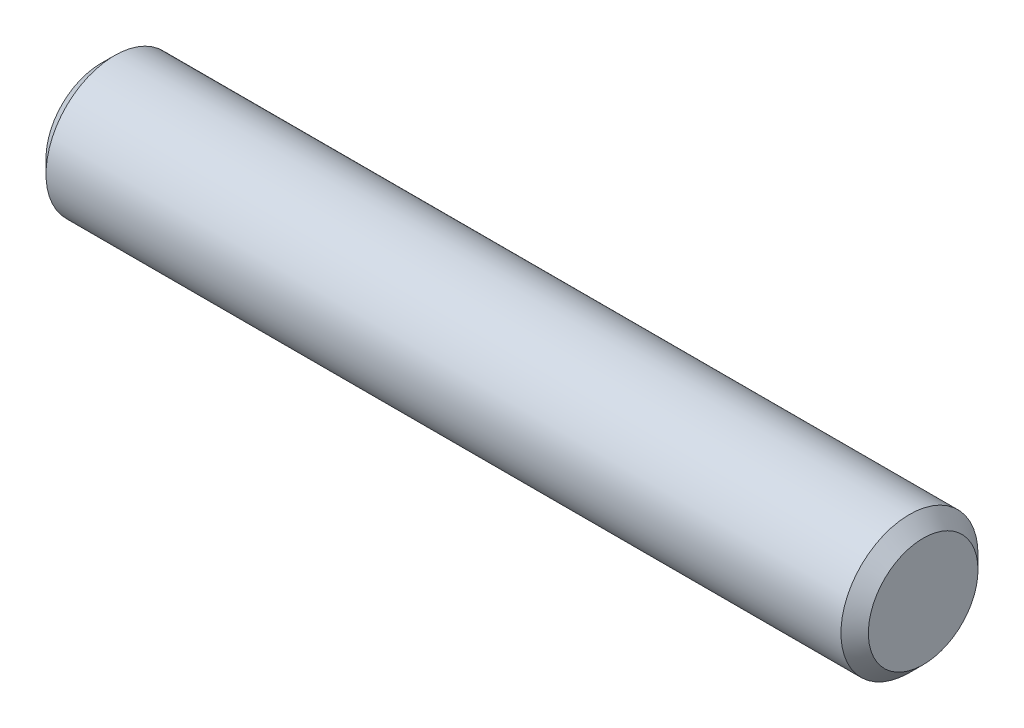
ISO-10303-21;
HEADER;
FILE_DESCRIPTION(('STEP AP214'),'2;1');
FILE_NAME('part.step','',(''),(''),'','','');
FILE_SCHEMA(('AUTOMOTIVE_DESIGN { 1 0 10303 214 1 1 1 1 }'));
ENDSEC;
DATA;
#1=APPLICATION_CONTEXT('core data for automotive mechanical design processes');
#2=APPLICATION_PROTOCOL_DEFINITION('international standard','automotive_design',2000,#1);
#3=PRODUCT_CONTEXT('',#1,'mechanical');
#4=PRODUCT('Part','Part','',(#3));
#5=PRODUCT_RELATED_PRODUCT_CATEGORY('part','',(#4));
#6=PRODUCT_DEFINITION_FORMATION('','',#4);
#7=PRODUCT_DEFINITION_CONTEXT('part definition',#1,'design');
#8=PRODUCT_DEFINITION('design','',#6,#7);
#9=PRODUCT_DEFINITION_SHAPE('','',#8);
#10=(LENGTH_UNIT() NAMED_UNIT(*) SI_UNIT(.MILLI.,.METRE.));
#11=(NAMED_UNIT(*) PLANE_ANGLE_UNIT() SI_UNIT($,.RADIAN.));
#12=(NAMED_UNIT(*) SI_UNIT($,.STERADIAN.) SOLID_ANGLE_UNIT());
#13=UNCERTAINTY_MEASURE_WITH_UNIT(LENGTH_MEASURE(1.E-05),#10,'distance_accuracy_value','');
#14=(GEOMETRIC_REPRESENTATION_CONTEXT(3) GLOBAL_UNCERTAINTY_ASSIGNED_CONTEXT((#13)) GLOBAL_UNIT_ASSIGNED_CONTEXT((#10,
#11,#12)) REPRESENTATION_CONTEXT('',''));
#15=CARTESIAN_POINT('',(0.,0.,0.));
#16=DIRECTION('',(0.,0.,1.));
#17=DIRECTION('',(1.,0.,0.));
#18=AXIS2_PLACEMENT_3D('',#15,#16,#17);
#19=CARTESIAN_POINT('',(-9.52500000000002,0.,0.));
#20=DIRECTION('',(1.,0.,0.));
#21=DIRECTION('',(0.,0.,-1.));
#22=AXIS2_PLACEMENT_3D('',#19,#20,#21);
#23=CYLINDRICAL_SURFACE('',#22,1.5875);
#24=CARTESIAN_POINT('',(9.20749999999999,0.,0.));
#25=DIRECTION('',(1.,0.,0.));
#26=DIRECTION('',(0.,0.,-1.));
#27=AXIS2_PLACEMENT_3D('',#24,#25,#26);
#28=CIRCLE('',#27,1.5875);
#29=CARTESIAN_POINT('',(9.20749999999999,0.,-1.5875));
#30=VERTEX_POINT('',#29);
#31=EDGE_CURVE('E39',#30,#30,#28,.F.);
#32=ORIENTED_EDGE('',*,*,#31,.T.);
#33=EDGE_LOOP('',(#32));
#34=FACE_BOUND('',#33,.T.);
#35=CARTESIAN_POINT('',(-9.20749999999999,0.,0.));
#36=DIRECTION('',(1.,0.,0.));
#37=DIRECTION('',(0.,0.,-1.));
#38=AXIS2_PLACEMENT_3D('',#35,#36,#37);
#39=CIRCLE('',#38,1.5875);
#40=CARTESIAN_POINT('',(-9.20749999999999,0.,-1.58749999999999));
#41=VERTEX_POINT('',#40);
#42=EDGE_CURVE('E43',#41,#41,#39,.T.);
#43=ORIENTED_EDGE('',*,*,#42,.T.);
#44=EDGE_LOOP('',(#43));
#45=FACE_BOUND('',#44,.T.);
#46=ADVANCED_FACE('F32',(#34,#45),#23,.T.);
#47=CARTESIAN_POINT('',(-9.52500000000002,0.,0.));
#48=DIRECTION('',(1.,0.,0.));
#49=DIRECTION('',(0.,0.,-1.));
#50=AXIS2_PLACEMENT_3D('',#47,#48,#49);
#51=PLANE('',#50);
#52=CARTESIAN_POINT('',(-9.52500000000002,0.,0.));
#53=DIRECTION('',(1.,0.,0.));
#54=DIRECTION('',(0.,0.,-1.));
#55=AXIS2_PLACEMENT_3D('',#52,#53,#54);
#56=CIRCLE('',#55,1.27);
#57=CARTESIAN_POINT('',(-9.52500000000002,0.,-1.26999999999999));
#58=VERTEX_POINT('',#57);
#59=EDGE_CURVE('E10',#58,#58,#56,.F.);
#60=ORIENTED_EDGE('',*,*,#59,.T.);
#61=EDGE_LOOP('',(#60));
#62=FACE_BOUND('',#61,.T.);
#63=ADVANCED_FACE('F63',(#62),#51,.F.);
#64=CARTESIAN_POINT('',(9.52499999999995,0.,0.));
#65=DIRECTION('',(1.,0.,0.));
#66=DIRECTION('',(0.,0.,-1.));
#67=AXIS2_PLACEMENT_3D('',#64,#65,#66);
#68=PLANE('',#67);
#69=CARTESIAN_POINT('',(9.52499999999995,0.,0.));
#70=DIRECTION('',(1.,0.,0.));
#71=DIRECTION('',(0.,0.,-1.));
#72=AXIS2_PLACEMENT_3D('',#69,#70,#71);
#73=CIRCLE('',#72,1.27);
#74=CARTESIAN_POINT('',(9.52499999999995,0.,-1.27));
#75=VERTEX_POINT('',#74);
#76=EDGE_CURVE('E47',#75,#75,#73,.T.);
#77=ORIENTED_EDGE('',*,*,#76,.T.);
#78=EDGE_LOOP('',(#77));
#79=FACE_BOUND('',#78,.T.);
#80=ADVANCED_FACE('F53',(#79),#68,.T.);
#81=CARTESIAN_POINT('',(9.52499999999995,0.,0.));
#82=DIRECTION('',(-1.,0.,0.));
#83=DIRECTION('',(0.,0.,1.));
#84=AXIS2_PLACEMENT_3D('',#81,#82,#83);
#85=CONICAL_SURFACE('',#84,1.27,0.785398163397448);
#86=ORIENTED_EDGE('',*,*,#31,.F.);
#87=EDGE_LOOP('',(#86));
#88=FACE_BOUND('',#87,.T.);
#89=ORIENTED_EDGE('',*,*,#76,.F.);
#90=EDGE_LOOP('',(#89));
#91=FACE_BOUND('',#90,.T.);
#92=ADVANCED_FACE('F55',(#88,#91),#85,.T.);
#93=CARTESIAN_POINT('',(-9.20749999999999,0.,0.));
#94=DIRECTION('',(1.,0.,0.));
#95=DIRECTION('',(0.,0.,-1.));
#96=AXIS2_PLACEMENT_3D('',#93,#94,#95);
#97=CONICAL_SURFACE('',#96,1.5875,0.785398163397453);
#98=ORIENTED_EDGE('',*,*,#59,.F.);
#99=EDGE_LOOP('',(#98));
#100=FACE_BOUND('',#99,.T.);
#101=ORIENTED_EDGE('',*,*,#42,.F.);
#102=EDGE_LOOP('',(#101));
#103=FACE_BOUND('',#102,.T.);
#104=ADVANCED_FACE('F34',(#100,#103),#97,.T.);
#105=CLOSED_SHELL('',(#46,#63,#80,#92,#104));
#106=MANIFOLD_SOLID_BREP('B2',#105);
#107=ADVANCED_BREP_SHAPE_REPRESENTATION('',(#18,#106),#14);
#108=SHAPE_DEFINITION_REPRESENTATION(#9,#107);
ENDSEC;
END-ISO-10303-21;
